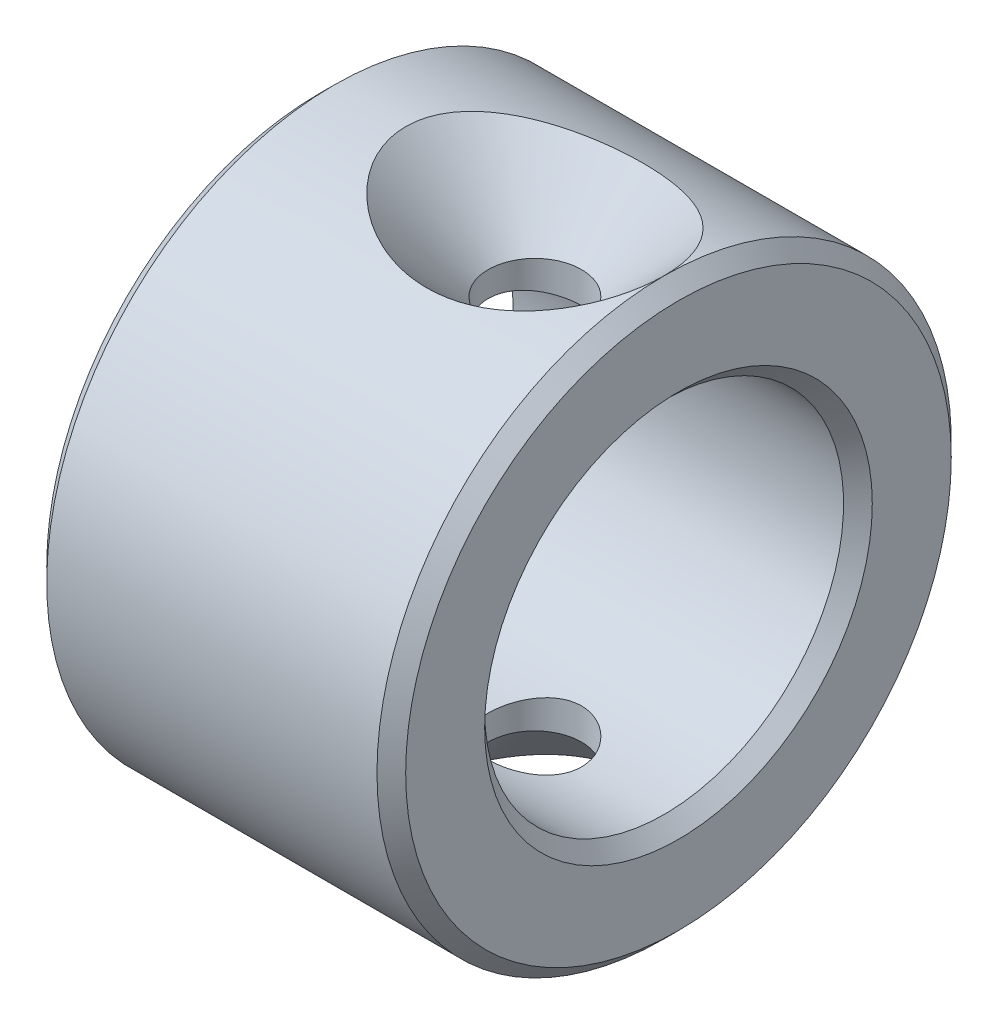
ISO-10303-21;
HEADER;
FILE_DESCRIPTION(('STEP AP214'),'2;1');
FILE_NAME('part.step','',(''),(''),'','','');
FILE_SCHEMA(('AUTOMOTIVE_DESIGN { 1 0 10303 214 1 1 1 1 }'));
ENDSEC;
DATA;
#1=APPLICATION_CONTEXT('core data for automotive mechanical design processes');
#2=APPLICATION_PROTOCOL_DEFINITION('international standard','automotive_design',2000,#1);
#3=PRODUCT_CONTEXT('',#1,'mechanical');
#4=PRODUCT('Part','Part','',(#3));
#5=PRODUCT_RELATED_PRODUCT_CATEGORY('part','',(#4));
#6=PRODUCT_DEFINITION_FORMATION('','',#4);
#7=PRODUCT_DEFINITION_CONTEXT('part definition',#1,'design');
#8=PRODUCT_DEFINITION('design','',#6,#7);
#9=PRODUCT_DEFINITION_SHAPE('','',#8);
#10=(LENGTH_UNIT() NAMED_UNIT(*) SI_UNIT(.MILLI.,.METRE.));
#11=(NAMED_UNIT(*) PLANE_ANGLE_UNIT() SI_UNIT($,.RADIAN.));
#12=(NAMED_UNIT(*) SI_UNIT($,.STERADIAN.) SOLID_ANGLE_UNIT());
#13=UNCERTAINTY_MEASURE_WITH_UNIT(LENGTH_MEASURE(1.E-05),#10,'distance_accuracy_value','');
#14=(GEOMETRIC_REPRESENTATION_CONTEXT(3) GLOBAL_UNCERTAINTY_ASSIGNED_CONTEXT((#13)) GLOBAL_UNIT_ASSIGNED_CONTEXT((#10,
#11,#12)) REPRESENTATION_CONTEXT('',''));
#15=CARTESIAN_POINT('',(0.,0.,0.));
#16=DIRECTION('',(0.,0.,1.));
#17=DIRECTION('',(1.,0.,0.));
#18=AXIS2_PLACEMENT_3D('',#15,#16,#17);
#19=CARTESIAN_POINT('',(36.3,12.4999999999999,0.));
#20=DIRECTION('',(1.,0.,0.));
#21=DIRECTION('',(0.,0.,-1.));
#22=AXIS2_PLACEMENT_3D('',#19,#20,#21);
#23=PLANE('',#22);
#24=CARTESIAN_POINT('',(36.3,0.,0.));
#25=DIRECTION('',(1.,0.,0.));
#26=DIRECTION('',(0.,0.,-1.));
#27=AXIS2_PLACEMENT_3D('',#24,#25,#26);
#28=CIRCLE('',#27,19.);
#29=CARTESIAN_POINT('',(36.3,0.,-19.));
#30=VERTEX_POINT('',#29);
#31=EDGE_CURVE('E62',#30,#30,#28,.F.);
#32=ORIENTED_EDGE('',*,*,#31,.T.);
#33=EDGE_LOOP('',(#32));
#34=FACE_BOUND('',#33,.T.);
#35=CARTESIAN_POINT('',(36.3,0.,0.));
#36=DIRECTION('',(1.,0.,0.));
#37=DIRECTION('',(0.,0.,-1.));
#38=AXIS2_PLACEMENT_3D('',#35,#36,#37);
#39=CIRCLE('',#38,13.4999999999999);
#40=CARTESIAN_POINT('',(36.3,0.,-13.4999999999999));
#41=VERTEX_POINT('',#40);
#42=EDGE_CURVE('E67',#41,#41,#39,.T.);
#43=ORIENTED_EDGE('',*,*,#42,.T.);
#44=EDGE_LOOP('',(#43));
#45=FACE_BOUND('',#44,.T.);
#46=ADVANCED_FACE('F37',(#34,#45),#23,.F.);
#47=CARTESIAN_POINT('',(0.,0.,0.));
#48=DIRECTION('',(-1.,0.,0.));
#49=DIRECTION('',(0.,0.,1.));
#50=AXIS2_PLACEMENT_3D('',#47,#48,#49);
#51=CYLINDRICAL_SURFACE('',#50,20.);
#52=CARTESIAN_POINT('',(37.3,0.,0.));
#53=DIRECTION('',(1.,0.,0.));
#54=DIRECTION('',(0.,0.,-1.));
#55=AXIS2_PLACEMENT_3D('',#52,#53,#54);
#56=CIRCLE('',#55,20.);
#57=CARTESIAN_POINT('',(37.3,0.,-20.));
#58=VERTEX_POINT('',#57);
#59=EDGE_CURVE('E64',#58,#58,#56,.T.);
#60=ORIENTED_EDGE('',*,*,#59,.T.);
#61=EDGE_LOOP('',(#60));
#62=FACE_BOUND('',#61,.T.);
#63=CARTESIAN_POINT('',(45.3661882820473,19.1877706412002,-5.64176066145125));
#64=CARTESIAN_POINT('',(45.577732190403,19.141917104968,-5.79771057600636));
#65=CARTESIAN_POINT('',(45.7963150995927,19.0967625568969,-5.94427137999793));
#66=CARTESIAN_POINT('',(46.2456100984595,19.0092602381062,-6.21841856708456));
#67=CARTESIAN_POINT('',(46.4763229261769,18.9669126385296,-6.3460037938051));
#68=CARTESIAN_POINT('',(46.9485214670462,18.8862387625164,-6.58221840475028));
#69=CARTESIAN_POINT('',(47.1900282561353,18.8479208911516,-6.69080847043349));
#70=CARTESIAN_POINT('',(47.6815283711968,18.7765869629439,-6.88845545427897));
#71=CARTESIAN_POINT('',(47.931517816354,18.7435685201962,-6.97752116932466));
#72=CARTESIAN_POINT('',(48.4400666061344,18.6836254099467,-7.13648445994194));
#73=CARTESIAN_POINT('',(48.6986716388829,18.65674241988,-7.20625158304547));
#74=CARTESIAN_POINT('',(49.2211379171061,18.6101967108438,-7.32561849030915));
#75=CARTESIAN_POINT('',(49.4849992678527,18.5905341366362,-7.37521787012867));
#76=CARTESIAN_POINT('',(50.0160265417206,18.5590704601672,-7.45403964503474));
#77=CARTESIAN_POINT('',(50.2831900656966,18.5472639570202,-7.48327603989809));
#78=CARTESIAN_POINT('',(50.819204290621,18.5318735159258,-7.52130873489738));
#79=CARTESIAN_POINT('',(51.0880550031865,18.5282896346572,-7.53010489413857));
#80=CARTESIAN_POINT('',(51.6331263409161,18.5294791632512,-7.52717812946421));
#81=CARTESIAN_POINT('',(51.9093435491838,18.534488263417,-7.51487653373501));
#82=CARTESIAN_POINT('',(52.4596787450504,18.553147120805,-7.46869118594153));
#83=CARTESIAN_POINT('',(52.7337966708629,18.566797131366,-7.43480680110151));
#84=CARTESIAN_POINT('',(53.2781509452265,18.6022818216487,-7.34557106216145));
#85=CARTESIAN_POINT('',(53.5483848192548,18.6241214981632,-7.29020660162347));
#86=CARTESIAN_POINT('',(54.0828873721548,18.6752482648692,-7.15821944697461));
#87=CARTESIAN_POINT('',(54.3471561109707,18.7045352801855,-7.08159696659028));
#88=CARTESIAN_POINT('',(54.8680541698992,18.7696125531925,-6.90726446523018));
#89=CARTESIAN_POINT('',(55.1246774593281,18.8054077943107,-6.80953827404841));
#90=CARTESIAN_POINT('',(55.6281973286769,18.8823175425032,-6.59327333160745));
#91=CARTESIAN_POINT('',(55.8750932407363,18.9234324139844,-6.47473315434353));
#92=CARTESIAN_POINT('',(56.3570699698337,19.0096194747789,-6.21713725228475));
#93=CARTESIAN_POINT('',(56.5921574266484,19.0546894001352,-6.07809323370603));
#94=CARTESIAN_POINT('',(57.0485630651927,19.1473096896259,-5.77970021812205));
#95=CARTESIAN_POINT('',(57.2698788396918,19.1948604847501,-5.62034768603154));
#96=CARTESIAN_POINT('',(57.8270494406332,19.3202088634302,-5.17785012580951));
#97=CARTESIAN_POINT('',(58.1502271952167,19.3987286250415,-4.87857509816132));
#98=CARTESIAN_POINT('',(58.7431229857137,19.5503309279786,-4.23025362284586));
#99=CARTESIAN_POINT('',(59.0129143923237,19.623420844163,-3.88127663349534));
#100=CARTESIAN_POINT('',(59.4453100702474,19.7445359123968,-3.20168321646487));
#101=CARTESIAN_POINT('',(59.6183611719667,19.794709932694,-2.87817806602763));
#102=CARTESIAN_POINT('',(59.8372206357975,19.8593138136756,-2.37413312734328));
#103=CARTESIAN_POINT('',(59.9033999970704,19.8790761569803,-2.20293802955232));
#104=CARTESIAN_POINT('',(60.0212527615976,19.9145307134903,-1.85524534386217));
#105=CARTESIAN_POINT('',(60.072932349041,19.9302246616584,-1.67875005217403));
#106=CARTESIAN_POINT('',(60.161211581182,19.957169060155,-1.32055375601052));
#107=CARTESIAN_POINT('',(60.1977184687699,19.9683921614947,-1.1388277892107));
#108=CARTESIAN_POINT('',(60.2545350289981,19.9859076483079,-0.772696922655417));
#109=CARTESIAN_POINT('',(60.2748518664896,19.992202214866,-0.58829324474216));
#110=CARTESIAN_POINT('',(60.2989250477998,19.9996643737325,-0.21830875253688));
#111=CARTESIAN_POINT('',(60.3026820371883,20.0008321659032,-0.0327279844150399));
#112=CARTESIAN_POINT('',(60.2935647123748,19.9980031302872,0.337973702304717));
#113=CARTESIAN_POINT('',(60.2806915198699,19.9940066508278,0.523094651073423));
#114=CARTESIAN_POINT('',(60.240512902205,19.981582766579,0.874238887617481));
#115=CARTESIAN_POINT('',(60.2146525014311,19.9735993854679,1.04044486106592));
#116=CARTESIAN_POINT('',(60.1498515401606,19.9537026305872,1.37006416328419));
#117=CARTESIAN_POINT('',(60.1109068250857,19.9417880085774,1.53347658769527));
#118=CARTESIAN_POINT('',(59.9752460763872,19.9005743767551,2.01786369938641));
#119=CARTESIAN_POINT('',(59.8596695112022,19.8657947306475,2.33327414736424));
#120=CARTESIAN_POINT('',(59.5781439746767,19.7830442005957,2.95537219346707));
#121=CARTESIAN_POINT('',(59.4102218810732,19.7345651526755,3.26108295387044));
#122=CARTESIAN_POINT('',(59.0332638355544,19.6292854294123,3.84435633065447));
#123=CARTESIAN_POINT('',(58.8242098698091,19.572481110782,4.12190653301942));
#124=CARTESIAN_POINT('',(58.3345417942238,19.4449783397175,4.68944078756375));
#125=CARTESIAN_POINT('',(58.0478131290535,19.3735313796995,4.97396064434115));
#126=CARTESIAN_POINT('',(57.4367850824208,19.230932672469,5.49959440823054));
#127=CARTESIAN_POINT('',(57.1124597105224,19.1597811651235,5.74067799040922));
#128=CARTESIAN_POINT('',(56.5714510744871,19.0508413941633,6.08966390926494));
#129=CARTESIAN_POINT('',(56.3642633653673,19.0111949272514,6.21200365655833));
#130=CARTESIAN_POINT('',(55.9407404479716,18.9349281612443,6.44073290708777));
#131=CARTESIAN_POINT('',(55.7244068439809,18.8983073347222,6.54712519291447));
#132=CARTESIAN_POINT('',(55.2837844066283,18.8289978058342,6.743866001199));
#133=CARTESIAN_POINT('',(55.059490075789,18.796311892028,6.83420316719718));
#134=CARTESIAN_POINT('',(54.6044505663682,18.7357371938619,6.99855835812374));
#135=CARTESIAN_POINT('',(54.3737072808931,18.7078470185441,7.07258111665012));
#136=CARTESIAN_POINT('',(53.8801611902809,18.6546787939997,7.211736663924));
#137=CARTESIAN_POINT('',(53.6167204229781,18.6300688268356,7.27487148552467));
#138=CARTESIAN_POINT('',(53.0851227706648,18.588484886016,7.38047769237932));
#139=CARTESIAN_POINT('',(52.8169655408983,18.5715114729952,7.42294756054259));
#140=CARTESIAN_POINT('',(52.2777902665976,18.5457606523437,7.4870527739039));
#141=CARTESIAN_POINT('',(52.0067723390022,18.5369829109951,7.50868896742532));
#142=CARTESIAN_POINT('',(51.4637381890416,18.5279148308089,7.53103694070083));
#143=CARTESIAN_POINT('',(51.1917219792933,18.5276243850724,7.53174898399793));
#144=CARTESIAN_POINT('',(50.6441430390888,18.5356052971002,7.51208715051307));
#145=CARTESIAN_POINT('',(50.3685945956897,18.5440160044148,7.49137008597982));
#146=CARTESIAN_POINT('',(49.8203565036833,18.5693249997874,7.42841273778948));
#147=CARTESIAN_POINT('',(49.5476669296469,18.5862235086816,7.38617189412435));
#148=CARTESIAN_POINT('',(49.0069370638226,18.6279446911686,7.28030979677627));
#149=CARTESIAN_POINT('',(48.7388992894716,18.6527715225384,7.21667732395329));
#150=CARTESIAN_POINT('',(48.2095160816436,18.7095160187439,7.06826123676384));
#151=CARTESIAN_POINT('',(47.9481705820803,18.7414336135281,6.9834778313517));
#152=CARTESIAN_POINT('',(47.4336164227386,18.8113684856986,6.7928444103133));
#153=CARTESIAN_POINT('',(47.180421894673,18.8493957369448,6.68695987850548));
#154=CARTESIAN_POINT('',(46.6845138889148,18.9302732944538,6.45444826058517));
#155=CARTESIAN_POINT('',(46.4418012203009,18.973123972112,6.32781957686648));
#156=CARTESIAN_POINT('',(45.9690255190143,19.0622163410545,6.05413855928852));
#157=CARTESIAN_POINT('',(45.7389536242147,19.10845560221,5.90710079547429));
#158=CARTESIAN_POINT('',(45.2934602617766,19.2027971014902,5.59280860745084));
#159=CARTESIAN_POINT('',(45.0780409507389,19.250899612224,5.42555121728875));
#160=CARTESIAN_POINT('',(44.5456598615883,19.374921255705,4.96949746636897));
#161=CARTESIAN_POINT('',(44.2411198591912,19.4510089332831,4.66591550802323));
#162=CARTESIAN_POINT('',(43.6856450612367,19.5963066967062,4.01205331343991));
#163=CARTESIAN_POINT('',(43.4346354972137,19.6655263022307,3.66183933652834));
#164=CARTESIAN_POINT('',(43.0345965038463,19.7791625377996,2.98048510149414));
#165=CARTESIAN_POINT('',(42.8755917683829,19.8257853084296,2.65564449299649));
#166=CARTESIAN_POINT('',(42.6778515582079,19.8846780398251,2.15137031538692));
#167=CARTESIAN_POINT('',(42.6187219107511,19.9024721108263,1.98039366013911));
#168=CARTESIAN_POINT('',(42.5148940661462,19.9339161066511,1.63376929155827));
#169=CARTESIAN_POINT('',(42.4701898504123,19.9475677596342,1.45812355945344));
#170=CARTESIAN_POINT('',(42.3957480795781,19.970393419116,1.10241863474314));
#171=CARTESIAN_POINT('',(42.3660914439929,19.9795432086878,0.922340928510026));
#172=CARTESIAN_POINT('',(42.3226397766657,19.9929743664942,0.560170020952354));
#173=CARTESIAN_POINT('',(42.3088380198171,19.9972577988655,0.378077707272107));
#174=CARTESIAN_POINT('',(42.2973335620148,20.0008271477838,0.0133307818675456));
#175=CARTESIAN_POINT('',(42.2996312553884,20.0001129419226,-0.16932384352006));
#176=CARTESIAN_POINT('',(42.3202818718248,19.9937098825421,-0.533624152558817));
#177=CARTESIAN_POINT('',(42.3386339495925,19.988021290934,-0.715269888823258));
#178=CARTESIAN_POINT('',(42.3889360811823,19.9725013978451,-1.06147972427417));
#179=CARTESIAN_POINT('',(42.4196683938164,19.9630417248463,-1.22623870460533));
#180=CARTESIAN_POINT('',(42.493942714319,19.9403175266831,-1.55259566997125));
#181=CARTESIAN_POINT('',(42.5374890507987,19.927051715833,-1.71419256714118));
#182=CARTESIAN_POINT('',(42.6864872316387,19.8820099157473,-2.19271465383853));
#183=CARTESIAN_POINT('',(42.8103318737437,19.8449788487993,-2.50359557917911));
#184=CARTESIAN_POINT('',(43.1094331205887,19.7577324962919,-3.12006896211652));
#185=CARTESIAN_POINT('',(43.2872630180229,19.7068751764916,-3.42429992086937));
#186=CARTESIAN_POINT('',(43.6835430905959,19.5974681447687,-4.00325661523126));
#187=CARTESIAN_POINT('',(43.901987886473,19.5389194518351,-4.2779862505659));
#188=CARTESIAN_POINT('',(44.3229658179226,19.4310629475309,-4.74108099117371));
#189=CARTESIAN_POINT('',(44.5191587958525,19.3824063083168,-4.93544855144283));
#190=CARTESIAN_POINT('',(44.92970904337,19.2848331379817,-5.30391635293349));
#191=CARTESIAN_POINT('',(45.1440684582177,19.2359165768078,-5.47801419474155));
#192=CARTESIAN_POINT('',(45.3661882820473,19.1877706412002,-5.64176066145125));
#193=B_SPLINE_CURVE_WITH_KNOTS('',3,(#63,#64,#65,#66,#67,#68,#69,#70,#71,#72,#73,#74,#75,#76,
#77,#78,#79,#80,#81,#82,#83,#84,#85,#86,#87,#88,#89,#90,#91,#92,#93,#94,#95,#96,#97,#98,#99,
#100,#101,#102,#103,#104,#105,#106,#107,#108,#109,#110,#111,#112,#113,#114,#115,#116,#117,#118,
#119,#120,#121,#122,#123,#124,#125,#126,#127,#128,#129,#130,#131,#132,#133,#134,#135,#136,#137,
#138,#139,#140,#141,#142,#143,#144,#145,#146,#147,#148,#149,#150,#151,#152,#153,#154,#155,#156,
#157,#158,#159,#160,#161,#162,#163,#164,#165,#166,#167,#168,#169,#170,#171,#172,#173,#174,#175,
#176,#177,#178,#179,#180,#181,#182,#183,#184,#185,#186,#187,#188,#189,#190,#191,#192),
.UNSPECIFIED.,.T.,.F.,(4,2,2,2,2,2,2,2,2,2,2,2,2,2,2,2,2,2,2,2,2,2,2,2,2,2,2,2,2,2,2,2,2,2,2,2,
2,2,2,2,2,2,2,2,2,2,2,2,2,2,2,2,2,2,2,2,2,2,2,2,2,2,2,2,4),(0.,0.800069270745542,
1.60018727787268,2.40194235935162,3.20333545651176,4.01002023157753,4.81672117897074,
5.62286696163884,6.42901830106146,7.25763602942668,8.08627805276693,8.91542648349331,
9.74456657832514,10.5743442502124,11.4041787939028,12.2335413831202,13.0630485364492,
14.3995898919451,15.73428143661,16.8401271893166,17.3933498328484,17.9463361656392,
18.5026551022329,19.058727704848,19.6147786293182,20.1707920504049,20.6753776489863,
21.1801236170563,22.188761529684,23.2412907618776,24.2942819826812,25.5204767203226,
26.747524233497,27.478464345029,28.2092767697388,28.9406040889745,29.6717189346452,
30.4868179975888,31.3019768909469,32.1171025905646,32.9322180235393,33.7605927335179,
34.5889889973408,35.4178204047758,36.2466436243424,37.076833887769,37.9070881181968,
38.7367526497158,39.5665390301035,40.8710909827846,42.1738086965855,43.2627667241646,
43.8075476247167,44.3521009367446,44.8995523882687,45.4467715434502,45.9940041018329,
46.5412078490682,47.0442236133697,47.5474094931779,48.5531079123046,49.6173545078362,
50.6814602489429,51.5214288126123,52.3614967060851),.UNSPECIFIED.);
#194=CARTESIAN_POINT('',(60.3,20.,0.));
#195=VERTEX_POINT('',#194);
#196=EDGE_CURVE('E58',#195,#195,#193,.T.);
#197=ORIENTED_EDGE('',*,*,#196,.T.);
#198=CARTESIAN_POINT('',(60.3,0.,0.));
#199=DIRECTION('',(-1.,0.,0.));
#200=DIRECTION('',(0.,0.,1.));
#201=AXIS2_PLACEMENT_3D('',#198,#199,#200);
#202=CIRCLE('',#201,20.);
#203=CARTESIAN_POINT('',(60.3,-20.,0.));
#204=VERTEX_POINT('',#203);
#205=EDGE_CURVE('E61',#195,#204,#202,.T.);
#206=ORIENTED_EDGE('',*,*,#205,.T.);
#207=CARTESIAN_POINT('',(45.3661882820473,-19.1877706412002,-5.64176066145124));
#208=CARTESIAN_POINT('',(45.0449057123926,-19.2574080004804,-5.40490847746102));
#209=CARTESIAN_POINT('',(44.7398999390975,-19.3286593473517,-5.14645200058792));
#210=CARTESIAN_POINT('',(44.1704391735613,-19.4688838462948,-4.58754215187058));
#211=CARTESIAN_POINT('',(43.9059663149121,-19.5378579915489,-4.28710739582013));
#212=CARTESIAN_POINT('',(43.4405157018491,-19.6638234270022,-3.66453119346854));
#213=CARTESIAN_POINT('',(43.2368052717147,-19.7212702493996,-3.34455786614976));
#214=CARTESIAN_POINT('',(42.9717771623918,-19.7977762531425,-2.84199118407156));
#215=CARTESIAN_POINT('',(42.8901674829225,-19.8216747714953,-2.6706319517486));
#216=CARTESIAN_POINT('',(42.7415807480107,-19.8656183049488,-2.32123827071421));
#217=CARTESIAN_POINT('',(42.674597052076,-19.8856650683257,-2.14320689448774));
#218=CARTESIAN_POINT('',(42.5558850334628,-19.9214534300484,-1.78022511260883));
#219=CARTESIAN_POINT('',(42.5042731553343,-19.9371621044869,-1.59523328500681));
#220=CARTESIAN_POINT('',(42.4179271944536,-19.9635697242914,-1.22107627700393));
#221=CARTESIAN_POINT('',(42.3831850509363,-19.9742710621941,-1.03191313501846));
#222=CARTESIAN_POINT('',(42.3312367806215,-19.990309950773,-0.651020191196974));
#223=CARTESIAN_POINT('',(42.3140252423242,-19.9956491566714,-0.459291199936221));
#224=CARTESIAN_POINT('',(42.2974762671518,-20.0007823301858,-0.0750011528974376));
#225=CARTESIAN_POINT('',(42.2981369544129,-20.0005768797672,0.117559813435504));
#226=CARTESIAN_POINT('',(42.3162120380861,-19.9949714008229,0.479604453053279));
#227=CARTESIAN_POINT('',(42.3316917928468,-19.9901712263403,0.649196365110205));
#228=CARTESIAN_POINT('',(42.3763664733588,-19.9763748140553,0.986406778868955));
#229=CARTESIAN_POINT('',(42.405565704849,-19.9673772589477,1.15402464409239));
#230=CARTESIAN_POINT('',(42.5131285062407,-19.9344163386816,1.65204948517043));
#231=CARTESIAN_POINT('',(42.6114745499432,-19.904479019208,1.97795338370164));
#232=CARTESIAN_POINT('',(42.8574120106012,-19.8311700048451,2.61314899720907));
#233=CARTESIAN_POINT('',(43.005580788481,-19.7876412515889,2.92219413439898));
#234=CARTESIAN_POINT('',(43.3440795658969,-19.6910660454724,3.51454962405128));
#235=CARTESIAN_POINT('',(43.534425171919,-19.6380160709052,3.79785039559159));
#236=CARTESIAN_POINT('',(43.9816040750314,-19.5180257117113,4.37564857088859));
#237=CARTESIAN_POINT('',(44.244114638026,-19.4501927352044,4.66555101754192));
#238=CARTESIAN_POINT('',(44.8071914504138,-19.3127961768567,5.20514757836247));
#239=CARTESIAN_POINT('',(45.1077831301496,-19.243231463748,5.45481456803147));
#240=CARTESIAN_POINT('',(45.8007958008959,-19.0943432499805,5.95713251196229));
#241=CARTESIAN_POINT('',(46.1997310326996,-19.0157360147384,6.20101314364635));
#242=CARTESIAN_POINT('',(47.0309426756599,-18.8709175109981,6.62869787943343));
#243=CARTESIAN_POINT('',(47.463238755344,-18.8047136351973,6.81246620353317));
#244=CARTESIAN_POINT('',(48.159031331511,-18.7155957875628,7.05229601240129));
#245=CARTESIAN_POINT('',(48.4147444925474,-18.6863377080657,7.12922703049313));
#246=CARTESIAN_POINT('',(48.9321076861141,-18.6347143420842,7.26309987936407));
#247=CARTESIAN_POINT('',(49.1937582095625,-18.612349627809,7.32004005078388));
#248=CARTESIAN_POINT('',(49.7211739314832,-18.5752402300322,7.41370219499192));
#249=CARTESIAN_POINT('',(49.9869391367895,-18.5604955591882,7.45042413419614));
#250=CARTESIAN_POINT('',(50.5208181594106,-18.5390971534632,7.50351248986722));
#251=CARTESIAN_POINT('',(50.7889319556316,-18.5324433459893,7.5198790889662));
#252=CARTESIAN_POINT('',(51.3336155091031,-18.5273714950546,7.53236739959858));
#253=CARTESIAN_POINT('',(51.6102017833716,-18.5292017366181,7.52787877590998));
#254=CARTESIAN_POINT('',(52.1619845714394,-18.5416058923539,7.49727419300928));
#255=CARTESIAN_POINT('',(52.437181039434,-18.5521800928389,7.47115752560696));
#256=CARTESIAN_POINT('',(52.9843253947488,-18.5817145513015,7.39739548252365));
#257=CARTESIAN_POINT('',(53.2562719963791,-18.6006780222889,7.34974185824436));
#258=CARTESIAN_POINT('',(53.7948820855223,-18.6463482155772,7.23309176342256));
#259=CARTESIAN_POINT('',(54.0615456297955,-18.6730548546386,7.1640955223139));
#260=CARTESIAN_POINT('',(54.5877269730521,-18.7333241002815,7.00498396366849));
#261=CARTESIAN_POINT('',(54.8472442156401,-18.766887238992,6.91486700688516));
#262=CARTESIAN_POINT('',(55.3572450847422,-18.8397684839392,6.71375894500502));
#263=CARTESIAN_POINT('',(55.6077281559834,-18.8790869431701,6.60276655942581));
#264=CARTESIAN_POINT('',(56.0976463177476,-18.962185793867,6.36018363133899));
#265=CARTESIAN_POINT('',(56.3370858322818,-19.0059643756694,6.22860143148254));
#266=CARTESIAN_POINT('',(56.802985127652,-19.0965548413142,5.94505986318882));
#267=CARTESIAN_POINT('',(57.0294423271872,-19.1433673244786,5.79309646223577));
#268=CARTESIAN_POINT('',(57.6091896746744,-19.2693180197758,5.36385942536131));
#269=CARTESIAN_POINT('',(57.9496167154246,-19.3497532601198,5.06917785343582));
#270=CARTESIAN_POINT('',(58.5772192369061,-19.5066352357174,4.42719375641041));
#271=CARTESIAN_POINT('',(58.8644663896304,-19.5830872378852,4.07996321785309));
#272=CARTESIAN_POINT('',(59.3270814377166,-19.7108581742671,3.40271690914743));
#273=CARTESIAN_POINT('',(59.5132551148357,-19.7642300505496,3.08055673455247));
#274=CARTESIAN_POINT('',(59.7518486427311,-19.8340248757569,2.57688442952364));
#275=CARTESIAN_POINT('',(59.8246161823387,-19.855583766877,2.40553914471172));
#276=CARTESIAN_POINT('',(59.9555808753223,-19.894713370303,2.05695764052967));
#277=CARTESIAN_POINT('',(60.0137843464542,-19.9122858115831,1.879724013394));
#278=CARTESIAN_POINT('',(60.1150215833465,-19.9430346440735,1.51931009824467));
#279=CARTESIAN_POINT('',(60.1579516271518,-19.9561809461925,1.33609804202909));
#280=CARTESIAN_POINT('',(60.2273087714281,-19.9774974187275,0.966364175906482));
#281=CARTESIAN_POINT('',(60.2537434556391,-19.9856698758254,0.779843927564388));
#282=CARTESIAN_POINT('',(60.2896241019511,-19.9967768751754,0.40504081690859));
#283=CARTESIAN_POINT('',(60.2990722869282,-19.999712102778,0.216758188464281));
#284=CARTESIAN_POINT('',(60.3007974171267,-20.0002474606685,-0.159881804683023));
#285=CARTESIAN_POINT('',(60.2930757825629,-19.9978480322166,-0.348239161916267));
#286=CARTESIAN_POINT('',(60.2622871986204,-19.9883129476609,-0.704044943180901));
#287=CARTESIAN_POINT('',(60.2408790493917,-19.9816894401271,-0.871652589915464));
#288=CARTESIAN_POINT('',(60.1847198533899,-19.9643981733696,-1.20442168981136));
#289=CARTESIAN_POINT('',(60.1499645917969,-19.9537291366414,-1.36958235312363));
#290=CARTESIAN_POINT('',(60.0264026399821,-19.9160400509764,-1.85964485385707));
#291=CARTESIAN_POINT('',(59.9182723616051,-19.8833291788599,-2.17943046719425));
#292=CARTESIAN_POINT('',(59.6522970371496,-19.804649325773,-2.80699834358802));
#293=CARTESIAN_POINT('',(59.4930549420945,-19.7583112774939,-3.11413058802678));
#294=CARTESIAN_POINT('',(59.1330296697601,-19.6567849568151,-3.70130695556463));
#295=CARTESIAN_POINT('',(58.932229488909,-19.6015930639328,-3.98133992189745));
#296=CARTESIAN_POINT('',(58.4612902274183,-19.4772889399621,-4.55346213707538));
#297=CARTESIAN_POINT('',(58.1852084538526,-19.407355059515,-4.84046654180743));
#298=CARTESIAN_POINT('',(57.5953249215875,-19.2668789858956,-5.37244788879048));
#299=CARTESIAN_POINT('',(57.2814972987377,-19.1963364067107,-5.617395730894));
#300=CARTESIAN_POINT('',(56.560358604036,-19.0467886478036,-6.10716998817129));
#301=CARTESIAN_POINT('',(56.1466740078244,-18.9687635030109,-6.34292122818304));
#302=CARTESIAN_POINT('',(55.2869450628341,-18.8270647763475,-6.7519390216569));
#303=CARTESIAN_POINT('',(54.8408836636209,-18.7633988299438,-6.9251723606271));
#304=CARTESIAN_POINT('',(54.1272141859988,-18.680072273385,-7.14576071491147));
#305=CARTESIAN_POINT('',(53.8669694472898,-18.6533485803884,-7.21502254088902));
#306=CARTESIAN_POINT('',(53.3411817806472,-18.6072212702621,-7.33317096951107));
#307=CARTESIAN_POINT('',(53.0756384361507,-18.5878182310698,-7.38205596351519));
#308=CARTESIAN_POINT('',(52.5411136889495,-18.5569785111123,-7.4592403067118));
#309=CARTESIAN_POINT('',(52.2721320545785,-18.5455423700554,-7.4875382612647));
#310=CARTESIAN_POINT('',(51.7325687023845,-18.5310101649138,-7.52343279737586));
#311=CARTESIAN_POINT('',(51.4619870107205,-18.5279139648569,-7.53102971643811));
#312=CARTESIAN_POINT('',(50.9151952673823,-18.5301904717559,-7.5254272294465));
#313=CARTESIAN_POINT('',(50.6389905233495,-18.5357484525325,-7.51177286620434));
#314=CARTESIAN_POINT('',(50.0888012386278,-18.5554872760322,-7.4628801224319));
#315=CARTESIAN_POINT('',(49.8148168081461,-18.5696685441552,-7.42764067707627));
#316=CARTESIAN_POINT('',(49.2709802309995,-18.6061754962481,-7.3357132740213));
#317=CARTESIAN_POINT('',(49.001128458524,-18.6285019132263,-7.27902338590982));
#318=CARTESIAN_POINT('',(48.4675790011158,-18.6805285056317,-7.14443837669705));
#319=CARTESIAN_POINT('',(48.2038807566249,-18.7102280077218,-7.06654519189578));
#320=CARTESIAN_POINT('',(47.482100688748,-18.8017002282996,-6.82089362528351));
#321=CARTESIAN_POINT('',(47.0323972202598,-18.8704495081039,-6.63036710364499));
#322=CARTESIAN_POINT('',(46.1692332739736,-19.0212718017404,-6.18436881182459));
#323=CARTESIAN_POINT('',(45.7557459069284,-19.1033347992144,-5.928945784324));
#324=CARTESIAN_POINT('',(45.3661882820473,-19.1877706412002,-5.64176066145124));
#325=B_SPLINE_CURVE_WITH_KNOTS('',3,(#207,#208,#209,#210,#211,#212,#213,#214,#215,#216,#217,
#218,#219,#220,#221,#222,#223,#224,#225,#226,#227,#228,#229,#230,#231,#232,#233,#234,#235,#236,
#237,#238,#239,#240,#241,#242,#243,#244,#245,#246,#247,#248,#249,#250,#251,#252,#253,#254,#255,
#256,#257,#258,#259,#260,#261,#262,#263,#264,#265,#266,#267,#268,#269,#270,#271,#272,#273,#274,
#275,#276,#277,#278,#279,#280,#281,#282,#283,#284,#285,#286,#287,#288,#289,#290,#291,#292,#293,
#294,#295,#296,#297,#298,#299,#300,#301,#302,#303,#304,#305,#306,#307,#308,#309,#310,#311,#312,
#313,#314,#315,#316,#317,#318,#319,#320,#321,#322,#323,#324),.UNSPECIFIED.,.T.,.F.,(4,2,2,2,2,2,
2,2,2,2,2,2,2,2,2,2,2,2,2,2,2,2,2,2,2,2,2,2,2,2,2,2,2,2,2,2,2,2,2,2,2,2,2,2,2,2,2,2,2,2,2,2,2,2,
2,2,2,2,4),(0.,1.21447606452016,2.42841525373586,3.57414642654172,4.14744666096012,
4.72048606174236,5.29776195990498,5.87476174965895,6.45158337207428,7.02834445169119,
7.53880436179852,8.04942458244382,9.06969890566966,10.1022291050568,11.1351420064756,
12.3215873627363,13.5088292382691,14.9257976731664,16.3436079867395,17.1487308408847,
17.9539205092282,18.7591115150484,19.564295296484,20.39318902547,21.2221098968852,
22.0513485122249,22.8805782135312,23.7098722953435,24.539217262003,25.36822705784,
26.1974011197736,27.5636837509108,28.9281113833576,30.0507228786495,30.6123329147953,
31.1736989058024,31.7388074693025,32.3036560324056,32.868430673285,33.4331586001371,
33.9398424751845,34.446686485221,35.4594718585969,36.5027092937542,37.5463744183914,
38.7549248926696,39.9643082570376,41.4061768910249,42.8488104367401,43.6598989232225,
44.4710514286212,45.2822588792731,46.093453104143,46.9222540688823,47.7510959229427,
48.5800123855824,49.4088531763656,50.8825184796596,52.3550801927897),.UNSPECIFIED.);
#326=EDGE_CURVE('E60',#204,#204,#325,.T.);
#327=ORIENTED_EDGE('',*,*,#326,.T.);
#328=CARTESIAN_POINT('',(60.3,0.,0.));
#329=DIRECTION('',(-1.,0.,0.));
#330=DIRECTION('',(0.,0.,1.));
#331=AXIS2_PLACEMENT_3D('',#328,#329,#330);
#332=CIRCLE('',#331,20.);
#333=EDGE_CURVE('E51',#204,#195,#332,.T.);
#334=ORIENTED_EDGE('',*,*,#333,.T.);
#335=EDGE_LOOP('',(#197,#206,#327,#334));
#336=FACE_BOUND('',#335,.T.);
#337=ADVANCED_FACE('F56',(#62,#336),#51,.T.);
#338=CARTESIAN_POINT('',(61.3,12.4999999999999,0.));
#339=DIRECTION('',(-1.,0.,0.));
#340=DIRECTION('',(0.,0.,1.));
#341=AXIS2_PLACEMENT_3D('',#338,#339,#340);
#342=PLANE('',#341);
#343=CARTESIAN_POINT('',(61.3,0.,0.));
#344=DIRECTION('',(-1.,0.,0.));
#345=DIRECTION('',(0.,0.,1.));
#346=AXIS2_PLACEMENT_3D('',#343,#344,#345);
#347=CIRCLE('',#346,13.4999999999999);
#348=CARTESIAN_POINT('',(61.3,0.,13.4999999999999));
#349=VERTEX_POINT('',#348);
#350=EDGE_CURVE('E11',#349,#349,#347,.T.);
#351=ORIENTED_EDGE('',*,*,#350,.T.);
#352=EDGE_LOOP('',(#351));
#353=FACE_BOUND('',#352,.T.);
#354=CARTESIAN_POINT('',(61.3,0.,0.));
#355=DIRECTION('',(-1.,0.,0.));
#356=DIRECTION('',(0.,0.,1.));
#357=AXIS2_PLACEMENT_3D('',#354,#355,#356);
#358=CIRCLE('',#357,19.);
#359=CARTESIAN_POINT('',(61.3,0.,19.));
#360=VERTEX_POINT('',#359);
#361=EDGE_CURVE('E45',#360,#360,#358,.F.);
#362=ORIENTED_EDGE('',*,*,#361,.T.);
#363=EDGE_LOOP('',(#362));
#364=FACE_BOUND('',#363,.T.);
#365=ADVANCED_FACE('F81',(#353,#364),#342,.F.);
#366=CARTESIAN_POINT('',(0.,0.,0.));
#367=DIRECTION('',(-1.,0.,0.));
#368=DIRECTION('',(0.,0.,1.));
#369=AXIS2_PLACEMENT_3D('',#366,#367,#368);
#370=CYLINDRICAL_SURFACE('',#369,12.4999999999999);
#371=CARTESIAN_POINT('',(37.3,0.,0.));
#372=DIRECTION('',(1.,0.,0.));
#373=DIRECTION('',(0.,0.,-1.));
#374=AXIS2_PLACEMENT_3D('',#371,#372,#373);
#375=CIRCLE('',#374,12.4999999999999);
#376=CARTESIAN_POINT('',(37.3,0.,-12.4999999999999));
#377=VERTEX_POINT('',#376);
#378=EDGE_CURVE('E76',#377,#377,#375,.F.);
#379=ORIENTED_EDGE('',*,*,#378,.T.);
#380=EDGE_LOOP('',(#379));
#381=FACE_BOUND('',#380,.T.);
#382=CARTESIAN_POINT('',(60.3,0.,0.));
#383=DIRECTION('',(-1.,0.,0.));
#384=DIRECTION('',(0.,0.,1.));
#385=AXIS2_PLACEMENT_3D('',#382,#383,#384);
#386=CIRCLE('',#385,12.4999999999999);
#387=CARTESIAN_POINT('',(60.3,0.,12.4999999999999));
#388=VERTEX_POINT('',#387);
#389=EDGE_CURVE('E73',#388,#388,#386,.F.);
#390=ORIENTED_EDGE('',*,*,#389,.T.);
#391=EDGE_LOOP('',(#390));
#392=FACE_BOUND('',#391,.T.);
#393=CARTESIAN_POINT('',(51.3,-12.0701077045732,3.25));
#394=CARTESIAN_POINT('',(51.1207885954813,-12.0701109573981,3.24999535178112));
#395=CARTESIAN_POINT('',(50.9415271110855,-12.0741425908509,3.23512639697315));
#396=CARTESIAN_POINT('',(50.5881693023618,-12.0897881676304,3.17614884790337));
#397=CARTESIAN_POINT('',(50.4140757890962,-12.1014061612355,3.13202463437075));
#398=CARTESIAN_POINT('',(50.0762164630232,-12.1308216935702,3.01607533822268));
#399=CARTESIAN_POINT('',(49.9124369652352,-12.1486108310135,2.94428790118147));
#400=CARTESIAN_POINT('',(49.5992235998337,-12.1883536564638,2.77516657772717));
#401=CARTESIAN_POINT('',(49.4497906438448,-12.2103076088529,2.6778310693744));
#402=CARTESIAN_POINT('',(49.1659577814269,-12.2564913332898,2.45790196762269));
#403=CARTESIAN_POINT('',(49.0319495733315,-12.2807598507529,2.33481089596256));
#404=CARTESIAN_POINT('',(48.7862280196933,-12.3285031518503,2.0679353457567));
#405=CARTESIAN_POINT('',(48.6745168911415,-12.3519778563634,1.92414881191203));
#406=CARTESIAN_POINT('',(48.4749397364803,-12.3959194289911,1.61726111047983));
#407=CARTESIAN_POINT('',(48.3874612447029,-12.4163352528834,1.45389997653955));
#408=CARTESIAN_POINT('',(48.2413568196019,-12.4514152229143,1.11417056289528));
#409=CARTESIAN_POINT('',(48.1827262699012,-12.4660802892387,0.937804369516634));
#410=CARTESIAN_POINT('',(48.0972444185742,-12.4877324473614,0.58115774149852));
#411=CARTESIAN_POINT('',(48.0697272679288,-12.4948801723697,0.401046821083342));
#412=CARTESIAN_POINT('',(48.0451604063271,-12.5012531662287,0.0386327508821779));
#413=CARTESIAN_POINT('',(48.0481058382885,-12.500479698068,-0.143670044792211));
#414=CARTESIAN_POINT('',(48.0839075642838,-12.4912159156494,-0.500665123856318));
#415=CARTESIAN_POINT('',(48.1160447432983,-12.4829111371106,-0.675435069867298));
#416=CARTESIAN_POINT('',(48.2081583408352,-12.4597356136683,-1.0170108145033));
#417=CARTESIAN_POINT('',(48.2681363058879,-12.4448645040132,-1.18381617013482));
#418=CARTESIAN_POINT('',(48.4147924979954,-12.4099485405508,-1.50658740876953));
#419=CARTESIAN_POINT('',(48.5017209788508,-12.3898554928596,-1.66243415738995));
#420=CARTESIAN_POINT('',(48.6996194759968,-12.3466665928586,-1.95757621832139));
#421=CARTESIAN_POINT('',(48.8105939759615,-12.3235701808564,-2.0968684363271));
#422=CARTESIAN_POINT('',(49.0572671863207,-12.2760868825506,-2.35923845302993));
#423=CARTESIAN_POINT('',(49.19359361736,-12.2516820085966,-2.48172349723347));
#424=CARTESIAN_POINT('',(49.4851060251362,-12.2049448337487,-2.70223285928799));
#425=CARTESIAN_POINT('',(49.6402930370178,-12.1826126467308,-2.80025583365961));
#426=CARTESIAN_POINT('',(49.9663566235132,-12.1424802811444,-2.96948026869846));
#427=CARTESIAN_POINT('',(50.1373163418386,-12.1247062331818,-3.04052815701657));
#428=CARTESIAN_POINT('',(50.4893297967006,-12.0960312749222,-3.15268381624371));
#429=CARTESIAN_POINT('',(50.6703811605704,-12.0851287564036,-3.19379859308706));
#430=CARTESIAN_POINT('',(51.0319138101008,-12.0717718519796,-3.24391476190107));
#431=CARTESIAN_POINT('',(51.2122645433666,-12.0690857581666,-3.25379719756266));
#432=CARTESIAN_POINT('',(51.5720402014958,-12.0718332019215,-3.24358933567581));
#433=CARTESIAN_POINT('',(51.7514652175856,-12.0772659234554,-3.22350205042832));
#434=CARTESIAN_POINT('',(52.1009519843272,-12.0954157697152,-3.15469998588876));
#435=CARTESIAN_POINT('',(52.2711242389843,-12.1079997596081,-3.10650801182698));
#436=CARTESIAN_POINT('',(52.6009723579425,-12.1389056713157,-2.98344905344028));
#437=CARTESIAN_POINT('',(52.7606468993668,-12.1572283146204,-2.90857871482455));
#438=CARTESIAN_POINT('',(53.0686722501889,-12.1980276011192,-2.73247717350929));
#439=CARTESIAN_POINT('',(53.2167143520271,-12.2205834904773,-2.6307247762517));
#440=CARTESIAN_POINT('',(53.4939462489922,-12.2671181282772,-2.4043987998912));
#441=CARTESIAN_POINT('',(53.6231326744878,-12.291097129964,-2.27982115071729));
#442=CARTESIAN_POINT('',(53.8626073691843,-12.3385688083205,-2.00731864410625));
#443=CARTESIAN_POINT('',(53.9722832262937,-12.3620303224022,-1.85884911980557));
#444=CARTESIAN_POINT('',(54.1651513294656,-12.4051491994822,-1.54509249859946));
#445=CARTESIAN_POINT('',(54.2483449788849,-12.4248067640395,-1.37980629346376));
#446=CARTESIAN_POINT('',(54.3851385963343,-12.4579769251597,-1.03826690311395));
#447=CARTESIAN_POINT('',(54.4389567863995,-12.4715346991139,-0.86210571803438));
#448=CARTESIAN_POINT('',(54.5161145152479,-12.4911761164615,-0.502837049160071));
#449=CARTESIAN_POINT('',(54.5394604508988,-12.4972613285117,-0.319731031562751));
#450=CARTESIAN_POINT('',(54.5546267651941,-12.5012019892905,0.0424954133206577));
#451=CARTESIAN_POINT('',(54.5473476432301,-12.4992925217516,0.221576127725296));
#452=CARTESIAN_POINT('',(54.5035498152793,-12.4879858018464,0.575871036634164));
#453=CARTESIAN_POINT('',(54.4670321118936,-12.4785888062301,0.751085363506479));
#454=CARTESIAN_POINT('',(54.3662925313222,-12.4534054132526,1.09164766573276));
#455=CARTESIAN_POINT('',(54.3022453146038,-12.4376593358793,1.25705048407199));
#456=CARTESIAN_POINT('',(54.1484215044186,-12.4014288567052,1.57485660758887));
#457=CARTESIAN_POINT('',(54.0586414449483,-12.3809438166766,1.72725815801129));
#458=CARTESIAN_POINT('',(53.8532198655677,-12.3367798925156,2.01895989700419));
#459=CARTESIAN_POINT('',(53.7369755695591,-12.3130327153405,2.157825244317));
#460=CARTESIAN_POINT('',(53.4830795014073,-12.2653095573741,2.41438331885253));
#461=CARTESIAN_POINT('',(53.3454221916498,-12.2413335189068,2.53207055217988));
#462=CARTESIAN_POINT('',(53.0491930313259,-12.1953008053635,2.74532550015591));
#463=CARTESIAN_POINT('',(52.8902485671912,-12.1732938799441,2.84038727425697));
#464=CARTESIAN_POINT('',(52.5580819265396,-12.1343795273365,3.0023016148278));
#465=CARTESIAN_POINT('',(52.3848696190876,-12.1174686123343,3.06917348760504));
#466=CARTESIAN_POINT('',(52.060129694205,-12.0931300782526,3.1635630612591));
#467=CARTESIAN_POINT('',(51.9100714178757,-12.084564518986,3.19590306708417));
#468=CARTESIAN_POINT('',(51.6066874302689,-12.0730522257393,3.23912243522353));
#469=CARTESIAN_POINT('',(51.4533620525361,-12.0701049209339,3.25000397776241));
#470=CARTESIAN_POINT('',(51.3,-12.0701077045732,3.25));
#471=B_SPLINE_CURVE_WITH_KNOTS('',3,(#393,#394,#395,#396,#397,#398,#399,#400,#401,#402,#403,
#404,#405,#406,#407,#408,#409,#410,#411,#412,#413,#414,#415,#416,#417,#418,#419,#420,#421,#422,
#423,#424,#425,#426,#427,#428,#429,#430,#431,#432,#433,#434,#435,#436,#437,#438,#439,#440,#441,
#442,#443,#444,#445,#446,#447,#448,#449,#450,#451,#452,#453,#454,#455,#456,#457,#458,#459,#460,
#461,#462,#463,#464,#465,#466,#467,#468,#469,#470),.UNSPECIFIED.,.T.,.F.,(4,2,2,2,2,2,2,2,2,2,2,
2,2,2,2,2,2,2,2,2,2,2,2,2,2,2,2,2,2,2,2,2,2,2,2,2,2,2,4),(0.,0.537070585366152,1.07442814181089,
1.61105700156232,2.14771993786827,2.69590642873234,3.24414739847249,3.80070711961764,
4.35717774859144,4.9014997027847,5.44573486933553,5.9769164006885,6.50812744222306,
7.04442685876537,7.58082636107376,8.13290034432249,8.68500464131247,9.24020661254797,
9.7952785952877,10.3345457987712,10.8737588033624,11.4032475650856,11.9328029233325,
12.4734934119641,13.0142804074904,13.5698352862046,14.125360719806,14.6767011108399,
15.2279257434831,15.7630571972261,16.2981703019111,16.8299373742635,17.3617761049811,
17.9072189278757,18.4528030428377,19.0096330020193,19.5660809852347,20.0257315159239,
20.4853353427545),.UNSPECIFIED.);
#472=CARTESIAN_POINT('',(51.3,-12.0701077045732,3.25));
#473=VERTEX_POINT('',#472);
#474=EDGE_CURVE('E126',#473,#473,#471,.T.);
#475=ORIENTED_EDGE('',*,*,#474,.T.);
#476=EDGE_LOOP('',(#475));
#477=FACE_BOUND('',#476,.T.);
#478=CARTESIAN_POINT('',(51.3,12.0701077045732,3.25));
#479=CARTESIAN_POINT('',(51.4792114045187,12.0701109573981,3.24999535178112));
#480=CARTESIAN_POINT('',(51.6584728889145,12.0741425908509,3.23512639697315));
#481=CARTESIAN_POINT('',(52.0118306976382,12.0897881676304,3.17614884790337));
#482=CARTESIAN_POINT('',(52.1859242109038,12.1014061612355,3.13202463437075));
#483=CARTESIAN_POINT('',(52.5237835369768,12.1308216935702,3.01607533822268));
#484=CARTESIAN_POINT('',(52.6875630347648,12.1486108310135,2.94428790118147));
#485=CARTESIAN_POINT('',(53.0007764001663,12.1883536564638,2.77516657772717));
#486=CARTESIAN_POINT('',(53.1502093561552,12.2103076088529,2.6778310693744));
#487=CARTESIAN_POINT('',(53.4340422185732,12.2564913332898,2.45790196762269));
#488=CARTESIAN_POINT('',(53.5680504266685,12.2807598507529,2.33481089596256));
#489=CARTESIAN_POINT('',(53.8137719803068,12.3285031518503,2.0679353457567));
#490=CARTESIAN_POINT('',(53.9254831088586,12.3519778563634,1.92414881191203));
#491=CARTESIAN_POINT('',(54.1250602635197,12.3959194289911,1.61726111047983));
#492=CARTESIAN_POINT('',(54.2125387552971,12.4163352528834,1.45389997653955));
#493=CARTESIAN_POINT('',(54.3586431803981,12.4514152229143,1.11417056289528));
#494=CARTESIAN_POINT('',(54.4172737300988,12.4660802892387,0.937804369516635));
#495=CARTESIAN_POINT('',(54.5027555814259,12.4877324473614,0.581157741498522));
#496=CARTESIAN_POINT('',(54.5302727320712,12.4948801723697,0.401046821083344));
#497=CARTESIAN_POINT('',(54.5548395936729,12.5012531662287,0.0386327508821797));
#498=CARTESIAN_POINT('',(54.5518941617116,12.500479698068,-0.143670044792209));
#499=CARTESIAN_POINT('',(54.5160924357162,12.4912159156494,-0.500665123856317));
#500=CARTESIAN_POINT('',(54.4839552567018,12.4829111371106,-0.675435069867297));
#501=CARTESIAN_POINT('',(54.3918416591648,12.4597356136683,-1.0170108145033));
#502=CARTESIAN_POINT('',(54.3318636941121,12.4448645040132,-1.18381617013483));
#503=CARTESIAN_POINT('',(54.1852075020046,12.4099485405508,-1.50658740876953));
#504=CARTESIAN_POINT('',(54.0982790211492,12.3898554928596,-1.66243415738995));
#505=CARTESIAN_POINT('',(53.9003805240032,12.3466665928586,-1.95757621832139));
#506=CARTESIAN_POINT('',(53.7894060240386,12.3235701808564,-2.0968684363271));
#507=CARTESIAN_POINT('',(53.5427328136794,12.2760868825506,-2.35923845302993));
#508=CARTESIAN_POINT('',(53.4064063826401,12.2516820085966,-2.48172349723347));
#509=CARTESIAN_POINT('',(53.1148939748639,12.2049448337487,-2.70223285928799));
#510=CARTESIAN_POINT('',(52.9597069629822,12.1826126467308,-2.80025583365962));
#511=CARTESIAN_POINT('',(52.6336433764868,12.1424802811444,-2.96948026869846));
#512=CARTESIAN_POINT('',(52.4626836581614,12.1247062331818,-3.04052815701658));
#513=CARTESIAN_POINT('',(52.1106702032995,12.0960312749222,-3.15268381624371));
#514=CARTESIAN_POINT('',(51.9296188394296,12.0851287564036,-3.19379859308707));
#515=CARTESIAN_POINT('',(51.5680861898992,12.0717718519796,-3.24391476190107));
#516=CARTESIAN_POINT('',(51.3877354566335,12.0690857581666,-3.25379719756266));
#517=CARTESIAN_POINT('',(51.0279597985042,12.0718332019215,-3.24358933567581));
#518=CARTESIAN_POINT('',(50.8485347824144,12.0772659234554,-3.22350205042832));
#519=CARTESIAN_POINT('',(50.4990480156728,12.0954157697152,-3.15469998588876));
#520=CARTESIAN_POINT('',(50.3288757610158,12.1079997596081,-3.10650801182698));
#521=CARTESIAN_POINT('',(49.9990276420575,12.1389056713157,-2.98344905344028));
#522=CARTESIAN_POINT('',(49.8393531006332,12.1572283146204,-2.90857871482455));
#523=CARTESIAN_POINT('',(49.5313277498111,12.1980276011192,-2.7324771735093));
#524=CARTESIAN_POINT('',(49.383285647973,12.2205834904773,-2.6307247762517));
#525=CARTESIAN_POINT('',(49.1060537510078,12.2671181282772,-2.4043987998912));
#526=CARTESIAN_POINT('',(48.9768673255122,12.291097129964,-2.2798211507173));
#527=CARTESIAN_POINT('',(48.7373926308158,12.3385688083205,-2.00731864410625));
#528=CARTESIAN_POINT('',(48.6277167737063,12.3620303224022,-1.85884911980558));
#529=CARTESIAN_POINT('',(48.4348486705344,12.4051491994822,-1.54509249859947));
#530=CARTESIAN_POINT('',(48.3516550211152,12.4248067640395,-1.37980629346377));
#531=CARTESIAN_POINT('',(48.2148614036657,12.4579769251597,-1.03826690311396));
#532=CARTESIAN_POINT('',(48.1610432136005,12.4715346991139,-0.862105718034383));
#533=CARTESIAN_POINT('',(48.0838854847522,12.4911761164615,-0.502837049160074));
#534=CARTESIAN_POINT('',(48.0605395491013,12.4972613285117,-0.319731031562755));
#535=CARTESIAN_POINT('',(48.0453732348059,12.5012019892905,0.0424954133206528));
#536=CARTESIAN_POINT('',(48.0526523567699,12.4992925217516,0.221576127725291));
#537=CARTESIAN_POINT('',(48.0964501847208,12.4879858018464,0.57587103663416));
#538=CARTESIAN_POINT('',(48.1329678881065,12.4785888062301,0.751085363506476));
#539=CARTESIAN_POINT('',(48.2337074686778,12.4534054132526,1.09164766573276));
#540=CARTESIAN_POINT('',(48.2977546853962,12.4376593358793,1.257050484072));
#541=CARTESIAN_POINT('',(48.4515784955814,12.4014288567052,1.57485660758887));
#542=CARTESIAN_POINT('',(48.5413585550518,12.3809438166766,1.7272581580113));
#543=CARTESIAN_POINT('',(48.7467801344324,12.3367798925156,2.01895989700419));
#544=CARTESIAN_POINT('',(48.8630244304409,12.3130327153405,2.157825244317));
#545=CARTESIAN_POINT('',(49.1169204985927,12.2653095573741,2.41438331885253));
#546=CARTESIAN_POINT('',(49.2545778083502,12.2413335189068,2.53207055217988));
#547=CARTESIAN_POINT('',(49.5508069686741,12.1953008053635,2.74532550015591));
#548=CARTESIAN_POINT('',(49.7097514328088,12.1732938799441,2.84038727425697));
#549=CARTESIAN_POINT('',(50.0419180734605,12.1343795273365,3.0023016148278));
#550=CARTESIAN_POINT('',(50.2151303809125,12.1174686123343,3.06917348760504));
#551=CARTESIAN_POINT('',(50.539870305795,12.0931300782526,3.1635630612591));
#552=CARTESIAN_POINT('',(50.6899285821244,12.084564518986,3.19590306708418));
#553=CARTESIAN_POINT('',(50.9933125697311,12.0730522257393,3.23912243522353));
#554=CARTESIAN_POINT('',(51.146637947464,12.0701049209339,3.25000397776241));
#555=CARTESIAN_POINT('',(51.3,12.0701077045732,3.25));
#556=B_SPLINE_CURVE_WITH_KNOTS('',3,(#478,#479,#480,#481,#482,#483,#484,#485,#486,#487,#488,
#489,#490,#491,#492,#493,#494,#495,#496,#497,#498,#499,#500,#501,#502,#503,#504,#505,#506,#507,
#508,#509,#510,#511,#512,#513,#514,#515,#516,#517,#518,#519,#520,#521,#522,#523,#524,#525,#526,
#527,#528,#529,#530,#531,#532,#533,#534,#535,#536,#537,#538,#539,#540,#541,#542,#543,#544,#545,
#546,#547,#548,#549,#550,#551,#552,#553,#554,#555),.UNSPECIFIED.,.T.,.F.,(4,2,2,2,2,2,2,2,2,2,2,
2,2,2,2,2,2,2,2,2,2,2,2,2,2,2,2,2,2,2,2,2,2,2,2,2,2,2,4),(0.,0.537070585366145,1.07442814181089,
1.61105700156232,2.14771993786827,2.69590642873234,3.24414739847249,3.80070711961764,
4.35717774859144,4.9014997027847,5.44573486933552,5.97691640068849,6.50812744222306,
7.04442685876537,7.58082636107376,8.13290034432249,8.68500464131249,9.24020661254799,
9.79527859528771,10.3345457987712,10.8737588033624,11.4032475650856,11.9328029233325,
12.4734934119641,13.0142804074904,13.5698352862046,14.125360719806,14.6767011108399,
15.2279257434831,15.7630571972261,16.2981703019111,16.8299373742635,17.3617761049811,
17.9072189278757,18.4528030428377,19.0096330020193,19.5660809852347,20.0257315159239,
20.4853353427546),.UNSPECIFIED.);
#557=CARTESIAN_POINT('',(51.3,12.0701077045732,3.25));
#558=VERTEX_POINT('',#557);
#559=EDGE_CURVE('E129',#558,#558,#556,.T.);
#560=ORIENTED_EDGE('',*,*,#559,.T.);
#561=EDGE_LOOP('',(#560));
#562=FACE_BOUND('',#561,.T.);
#563=ADVANCED_FACE('F116',(#381,#392,#477,#562),#370,.F.);
#564=CARTESIAN_POINT('',(51.3,-97.0061524810268,0.));
#565=DIRECTION('',(0.,1.,0.));
#566=DIRECTION('',(0.,0.,1.));
#567=AXIS2_PLACEMENT_3D('',#564,#565,#566);
#568=CYLINDRICAL_SURFACE('',#567,3.25);
#569=CARTESIAN_POINT('',(51.3,14.25,0.));
#570=DIRECTION('',(0.,1.,0.));
#571=DIRECTION('',(0.,0.,1.));
#572=AXIS2_PLACEMENT_3D('',#569,#570,#571);
#573=CIRCLE('',#572,3.25);
#574=CARTESIAN_POINT('',(51.3,14.25,3.25));
#575=VERTEX_POINT('',#574);
#576=EDGE_CURVE('E133',#575,#575,#573,.T.);
#577=ORIENTED_EDGE('',*,*,#576,.T.);
#578=EDGE_LOOP('',(#577));
#579=FACE_BOUND('',#578,.T.);
#580=ORIENTED_EDGE('',*,*,#559,.F.);
#581=EDGE_LOOP('',(#580));
#582=FACE_BOUND('',#581,.T.);
#583=ADVANCED_FACE('F119',(#579,#582),#568,.F.);
#584=CARTESIAN_POINT('',(51.3,-14.25,0.));
#585=DIRECTION('',(0.,1.,0.));
#586=DIRECTION('',(0.,0.,1.));
#587=AXIS2_PLACEMENT_3D('',#584,#585,#586);
#588=CIRCLE('',#587,3.25);
#589=CARTESIAN_POINT('',(51.3,-14.25,3.25));
#590=VERTEX_POINT('',#589);
#591=EDGE_CURVE('E162',#590,#590,#588,.T.);
#592=ORIENTED_EDGE('',*,*,#591,.F.);
#593=EDGE_LOOP('',(#592));
#594=FACE_BOUND('',#593,.T.);
#595=ORIENTED_EDGE('',*,*,#474,.F.);
#596=EDGE_LOOP('',(#595));
#597=FACE_BOUND('',#596,.T.);
#598=ADVANCED_FACE('F145',(#594,#597),#568,.F.);
#599=CARTESIAN_POINT('',(51.3,20.,0.));
#600=DIRECTION('',(0.,1.,0.));
#601=DIRECTION('',(0.,0.,1.));
#602=AXIS2_PLACEMENT_3D('',#599,#600,#601);
#603=CONICAL_SURFACE('',#602,9.,0.785398163397448);
#604=ORIENTED_EDGE('',*,*,#576,.F.);
#605=EDGE_LOOP('',(#604));
#606=FACE_BOUND('',#605,.T.);
#607=ORIENTED_EDGE('',*,*,#196,.F.);
#608=EDGE_LOOP('',(#607));
#609=FACE_BOUND('',#608,.T.);
#610=ADVANCED_FACE('F148',(#606,#609),#603,.F.);
#611=CARTESIAN_POINT('',(51.3,-14.25,0.));
#612=DIRECTION('',(0.,-1.,0.));
#613=DIRECTION('',(0.,0.,-1.));
#614=AXIS2_PLACEMENT_3D('',#611,#612,#613);
#615=CONICAL_SURFACE('',#614,3.25,0.78539816339745);
#616=ORIENTED_EDGE('',*,*,#591,.T.);
#617=EDGE_LOOP('',(#616));
#618=FACE_BOUND('',#617,.T.);
#619=ORIENTED_EDGE('',*,*,#326,.F.);
#620=EDGE_LOOP('',(#619));
#621=FACE_BOUND('',#620,.T.);
#622=ADVANCED_FACE('F105',(#618,#621),#615,.F.);
#623=CARTESIAN_POINT('',(36.3,0.,0.));
#624=DIRECTION('',(1.,0.,0.));
#625=DIRECTION('',(0.,0.,-1.));
#626=AXIS2_PLACEMENT_3D('',#623,#624,#625);
#627=CONICAL_SURFACE('',#626,19.,0.785398163397448);
#628=ORIENTED_EDGE('',*,*,#59,.F.);
#629=EDGE_LOOP('',(#628));
#630=FACE_BOUND('',#629,.T.);
#631=ORIENTED_EDGE('',*,*,#31,.F.);
#632=EDGE_LOOP('',(#631));
#633=FACE_BOUND('',#632,.T.);
#634=ADVANCED_FACE('F102',(#630,#633),#627,.T.);
#635=CARTESIAN_POINT('',(37.3,0.,0.));
#636=DIRECTION('',(-1.,0.,0.));
#637=DIRECTION('',(0.,0.,1.));
#638=AXIS2_PLACEMENT_3D('',#635,#636,#637);
#639=CONICAL_SURFACE('',#638,12.4999999999999,0.785398163397451);
#640=ORIENTED_EDGE('',*,*,#42,.F.);
#641=EDGE_LOOP('',(#640));
#642=FACE_BOUND('',#641,.T.);
#643=ORIENTED_EDGE('',*,*,#378,.F.);
#644=EDGE_LOOP('',(#643));
#645=FACE_BOUND('',#644,.T.);
#646=ADVANCED_FACE('F88',(#642,#645),#639,.F.);
#647=CARTESIAN_POINT('',(61.3,0.,0.));
#648=DIRECTION('',(1.,0.,0.));
#649=DIRECTION('',(0.,0.,-1.));
#650=AXIS2_PLACEMENT_3D('',#647,#648,#649);
#651=CONICAL_SURFACE('',#650,13.4999999999999,0.785398163397444);
#652=ORIENTED_EDGE('',*,*,#389,.F.);
#653=EDGE_LOOP('',(#652));
#654=FACE_BOUND('',#653,.T.);
#655=ORIENTED_EDGE('',*,*,#350,.F.);
#656=EDGE_LOOP('',(#655));
#657=FACE_BOUND('',#656,.T.);
#658=ADVANCED_FACE('F84',(#654,#657),#651,.F.);
#659=CARTESIAN_POINT('',(60.3,0.,0.));
#660=DIRECTION('',(-1.,0.,0.));
#661=DIRECTION('',(0.,0.,1.));
#662=AXIS2_PLACEMENT_3D('',#659,#660,#661);
#663=CONICAL_SURFACE('',#662,20.,0.785398163397457);
#664=ORIENTED_EDGE('',*,*,#361,.F.);
#665=EDGE_LOOP('',(#664));
#666=FACE_BOUND('',#665,.T.);
#667=ORIENTED_EDGE('',*,*,#333,.F.);
#668=ORIENTED_EDGE('',*,*,#205,.F.);
#669=EDGE_LOOP('',(#667,#668));
#670=FACE_BOUND('',#669,.T.);
#671=ADVANCED_FACE('F39',(#666,#670),#663,.T.);
#672=CLOSED_SHELL('',(#46,#337,#365,#563,#583,#598,#610,#622,#634,#646,#658,#671));
#673=MANIFOLD_SOLID_BREP('B2',#672);
#674=ADVANCED_BREP_SHAPE_REPRESENTATION('',(#18,#673),#14);
#675=SHAPE_DEFINITION_REPRESENTATION(#9,#674);
ENDSEC;
END-ISO-10303-21;
